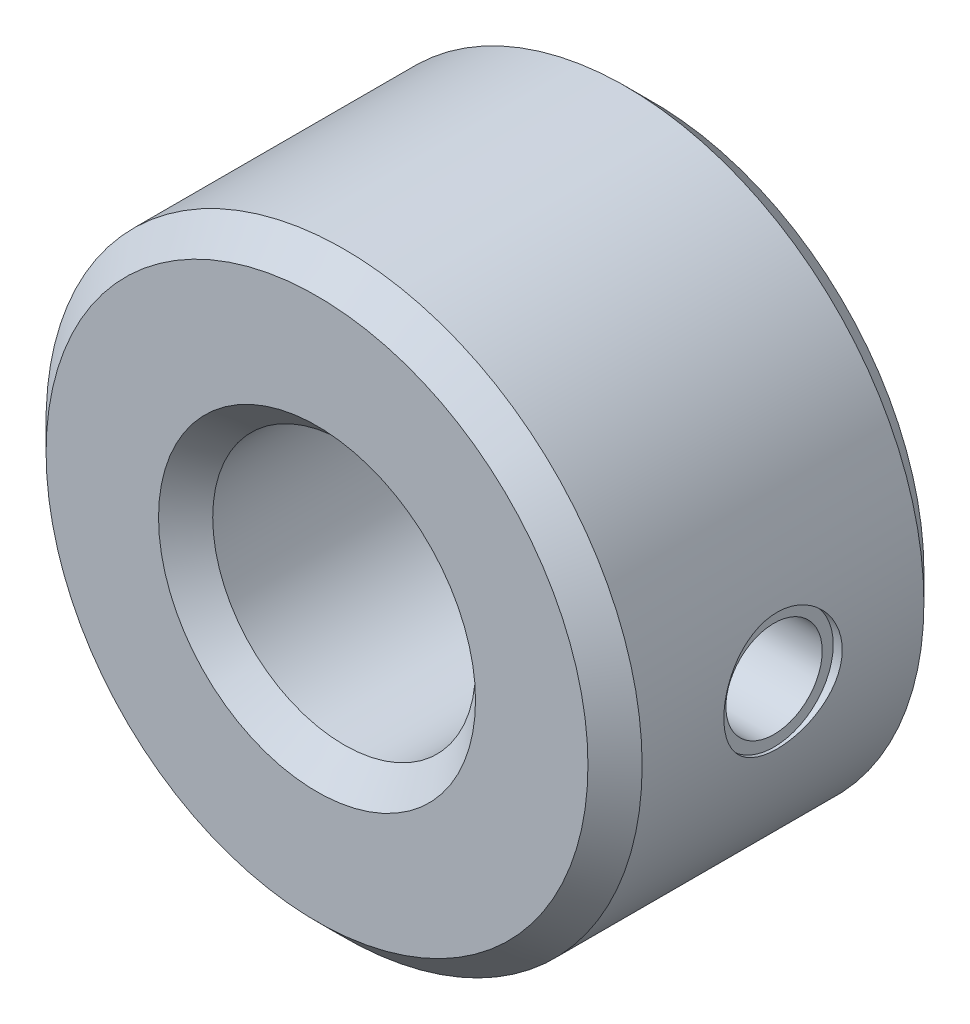
ISO-10303-21;
HEADER;
FILE_DESCRIPTION(('STEP AP214'),'2;1');
FILE_NAME('part.step','',(''),(''),'','','');
FILE_SCHEMA(('AUTOMOTIVE_DESIGN { 1 0 10303 214 1 1 1 1 }'));
ENDSEC;
DATA;
#1=APPLICATION_CONTEXT('core data for automotive mechanical design processes');
#2=APPLICATION_PROTOCOL_DEFINITION('international standard','automotive_design',2000,#1);
#3=PRODUCT_CONTEXT('',#1,'mechanical');
#4=PRODUCT('Part','Part','',(#3));
#5=PRODUCT_RELATED_PRODUCT_CATEGORY('part','',(#4));
#6=PRODUCT_DEFINITION_FORMATION('','',#4);
#7=PRODUCT_DEFINITION_CONTEXT('part definition',#1,'design');
#8=PRODUCT_DEFINITION('design','',#6,#7);
#9=PRODUCT_DEFINITION_SHAPE('','',#8);
#10=(LENGTH_UNIT() NAMED_UNIT(*) SI_UNIT(.MILLI.,.METRE.));
#11=(NAMED_UNIT(*) PLANE_ANGLE_UNIT() SI_UNIT($,.RADIAN.));
#12=(NAMED_UNIT(*) SI_UNIT($,.STERADIAN.) SOLID_ANGLE_UNIT());
#13=UNCERTAINTY_MEASURE_WITH_UNIT(LENGTH_MEASURE(1.E-05),#10,'distance_accuracy_value','');
#14=(GEOMETRIC_REPRESENTATION_CONTEXT(3) GLOBAL_UNCERTAINTY_ASSIGNED_CONTEXT((#13)) GLOBAL_UNIT_ASSIGNED_CONTEXT((#10,
#11,#12)) REPRESENTATION_CONTEXT('',''));
#15=CARTESIAN_POINT('',(0.,0.,0.));
#16=DIRECTION('',(0.,0.,1.));
#17=DIRECTION('',(1.,0.,0.));
#18=AXIS2_PLACEMENT_3D('',#15,#16,#17);
#19=CARTESIAN_POINT('',(0.,0.,2.59999999996512));
#20=DIRECTION('',(0.,0.,-1.));
#21=DIRECTION('',(-1.,0.,0.));
#22=AXIS2_PLACEMENT_3D('',#19,#20,#21);
#23=CONICAL_SURFACE('',#22,5.49999999987098,0.785398163397448);
#24=CARTESIAN_POINT('',(0.,0.,3.0999999998975));
#25=DIRECTION('',(0.,0.,1.));
#26=DIRECTION('',(1.,0.,0.));
#27=AXIS2_PLACEMENT_3D('',#24,#25,#26);
#28=CIRCLE('',#27,4.9999999999386);
#29=CARTESIAN_POINT('',(4.9999999999386,0.,3.0999999998975));
#30=VERTEX_POINT('',#29);
#31=EDGE_CURVE('E64',#30,#30,#28,.T.);
#32=ORIENTED_EDGE('',*,*,#31,.F.);
#33=EDGE_LOOP('',(#32));
#34=FACE_BOUND('',#33,.T.);
#35=CARTESIAN_POINT('',(0.,0.,2.59999999996512));
#36=DIRECTION('',(0.,0.,1.));
#37=DIRECTION('',(1.,0.,0.));
#38=AXIS2_PLACEMENT_3D('',#35,#36,#37);
#39=CIRCLE('',#38,5.49999999987098);
#40=CARTESIAN_POINT('',(5.49999999987098,0.,2.59999999996512));
#41=VERTEX_POINT('',#40);
#42=EDGE_CURVE('E10',#41,#41,#39,.T.);
#43=ORIENTED_EDGE('',*,*,#42,.T.);
#44=EDGE_LOOP('',(#43));
#45=FACE_BOUND('',#44,.T.);
#46=ADVANCED_FACE('F33',(#34,#45),#23,.T.);
#47=CARTESIAN_POINT('',(0.,0.,0.));
#48=DIRECTION('',(0.,0.,1.));
#49=DIRECTION('',(1.,0.,0.));
#50=AXIS2_PLACEMENT_3D('',#47,#48,#49);
#51=CYLINDRICAL_SURFACE('',#50,5.49999999987098);
#52=CARTESIAN_POINT('',(5.49999999987098,0.,-1.0922));
#53=CARTESIAN_POINT('',(5.4999988825837,-0.0607101232129737,-1.09219775609455));
#54=CARTESIAN_POINT('',(5.49898447977851,-0.121448708365151,-1.08712102316428));
#55=CARTESIAN_POINT('',(5.49503566367525,-0.241209661727449,-1.06696399701099));
#56=CARTESIAN_POINT('',(5.49209971397182,-0.300230617102368,-1.05187569873783));
#57=CARTESIAN_POINT('',(5.48463571286039,-0.414807398743242,-1.01217953319907));
#58=CARTESIAN_POINT('',(5.48010917668079,-0.470366463787665,-0.987580723631651));
#59=CARTESIAN_POINT('',(5.46995633835415,-0.576564866523423,-0.929588582793216));
#60=CARTESIAN_POINT('',(5.46433010443195,-0.627204509122269,-0.896195797052571));
#61=CARTESIAN_POINT('',(5.45251325206669,-0.722807169735393,-0.821090534500779));
#62=CARTESIAN_POINT('',(5.44631668432642,-0.767694986926346,-0.779283259975135));
#63=CARTESIAN_POINT('',(5.43410093997799,-0.849868711269153,-0.688739574431017));
#64=CARTESIAN_POINT('',(5.42808177712156,-0.887154030424212,-0.640002627948274));
#65=CARTESIAN_POINT('',(5.4168442893339,-0.953383600273373,-0.536443239116846));
#66=CARTESIAN_POINT('',(5.41163362092297,-0.982250143634702,-0.481570196113549));
#67=CARTESIAN_POINT('',(5.40268750519192,-1.03032496814664,-0.367632241251287));
#68=CARTESIAN_POINT('',(5.39895191432019,-1.04953418917835,-0.308567737957196));
#69=CARTESIAN_POINT('',(5.39343906549095,-1.07750528258289,-0.188732059035349));
#70=CARTESIAN_POINT('',(5.39163711542676,-1.08639900307728,-0.127992817377416));
#71=CARTESIAN_POINT('',(5.3901212347365,-1.09389613423502,-0.00585961765244284));
#72=CARTESIAN_POINT('',(5.39040709368507,-1.09250058192985,0.0555342738111984));
#73=CARTESIAN_POINT('',(5.39301209275884,-1.07956541897637,0.176270493881182));
#74=CARTESIAN_POINT('',(5.39530096430692,-1.06817681178237,0.235629750723884));
#75=CARTESIAN_POINT('',(5.40160644385572,-1.03581710938487,0.35157799764303));
#76=CARTESIAN_POINT('',(5.40562313331348,-1.01484556239594,0.408166856970469));
#77=CARTESIAN_POINT('',(5.41496269613146,-0.963770692785958,0.517403907568196));
#78=CARTESIAN_POINT('',(5.42029410397407,-0.933607387623006,0.570023293505699));
#79=CARTESIAN_POINT('',(5.43165688977912,-0.865047561118105,0.669510383150855));
#80=CARTESIAN_POINT('',(5.43768834705881,-0.826650106409138,0.71637743386528));
#81=CARTESIAN_POINT('',(5.44990285634747,-0.741902793202112,0.80390092540069));
#82=CARTESIAN_POINT('',(5.45608670025401,-0.695424022601307,0.844432535637155));
#83=CARTESIAN_POINT('',(5.46781126522681,-0.596262175775621,0.917143498749));
#84=CARTESIAN_POINT('',(5.47335197826643,-0.543579022132973,0.949322747388262));
#85=CARTESIAN_POINT('',(5.483179315787,-0.433366212874012,1.00443808103628));
#86=CARTESIAN_POINT('',(5.48746402179848,-0.375829314308617,1.02736004610524));
#87=CARTESIAN_POINT('',(5.49428198387236,-0.257617339178901,1.06317785057104));
#88=CARTESIAN_POINT('',(5.49681544904283,-0.196942638216196,1.07607488702404));
#89=CARTESIAN_POINT('',(5.49981640134946,-0.0752502519772616,1.09130035072367));
#90=CARTESIAN_POINT('',(5.50031728454035,-0.0142547412616139,1.09379963423744));
#91=CARTESIAN_POINT('',(5.49928933819061,0.107282369093851,1.08861857053011));
#92=CARTESIAN_POINT('',(5.49776062106432,0.167823993686482,1.08093878710137));
#93=CARTESIAN_POINT('',(5.49286612910723,0.286184662739495,1.05575954831863));
#94=CARTESIAN_POINT('',(5.48951673565154,0.344023063522988,1.0383476182225));
#95=CARTESIAN_POINT('',(5.48135506679043,0.4559593673962,0.994293882467879));
#96=CARTESIAN_POINT('',(5.476542682948,0.510056992854236,0.967651392618717));
#97=CARTESIAN_POINT('',(5.46590566743375,0.613697679422892,0.905522204864626));
#98=CARTESIAN_POINT('',(5.46006949987753,0.663177760485838,0.869932463552538));
#99=CARTESIAN_POINT('',(5.44805972673938,0.755524735338425,0.791057177745034));
#100=CARTESIAN_POINT('',(5.44188608557451,0.798390929936717,0.747770820636539));
#101=CARTESIAN_POINT('',(5.42978480912782,0.87695154789536,0.653953743420826));
#102=CARTESIAN_POINT('',(5.42386225264541,0.91252875681699,0.603324102236613));
#103=CARTESIAN_POINT('',(5.4130406766035,0.974674173285588,0.496707015802831));
#104=CARTESIAN_POINT('',(5.40814161640261,1.00124273857741,0.440719783423354));
#105=CARTESIAN_POINT('',(5.39996260729193,1.04445593485777,0.325256982636461));
#106=CARTESIAN_POINT('',(5.39667434247771,1.06115163028267,0.265801142762739));
#107=CARTESIAN_POINT('',(5.39207145238588,1.08430034524308,0.144855868606561));
#108=CARTESIAN_POINT('',(5.39075657383323,1.09075467921621,0.083366696328456));
#109=CARTESIAN_POINT('',(5.39026325277416,1.09318934845028,-0.0387232631786108));
#110=CARTESIAN_POINT('',(5.39104703759951,1.08935486377822,-0.0993202810323704));
#111=CARTESIAN_POINT('',(5.39457840935009,1.0717290590583,-0.218987177976653));
#112=CARTESIAN_POINT('',(5.39732598099302,1.05793781649457,-0.278057068947669));
#113=CARTESIAN_POINT('',(5.40445856907003,1.02087207022523,-0.392877228902362));
#114=CARTESIAN_POINT('',(5.40883971583554,0.997619965950032,-0.448634984763973));
#115=CARTESIAN_POINT('',(5.41874807986904,0.942313673220461,-0.555486937986287));
#116=CARTESIAN_POINT('',(5.42427539149153,0.910258760031397,-0.606580750903184));
#117=CARTESIAN_POINT('',(5.43596906680853,0.837622971725841,-0.703577187462301));
#118=CARTESIAN_POINT('',(5.44214458614618,0.796908242762451,-0.749378489039133));
#119=CARTESIAN_POINT('',(5.45437281759908,0.708385237708941,-0.833560201426262));
#120=CARTESIAN_POINT('',(5.46042550117137,0.660575333911476,-0.871938904749342));
#121=CARTESIAN_POINT('',(5.47179949202526,0.55862805925471,-0.940558502923561));
#122=CARTESIAN_POINT('',(5.47711263145339,0.504430634147923,-0.970711584469282));
#123=CARTESIAN_POINT('',(5.48632857296824,0.391648031665486,-1.02143459356755));
#124=CARTESIAN_POINT('',(5.49023265178984,0.333066884747255,-1.04201320136286));
#125=CARTESIAN_POINT('',(5.4954277643953,0.228624445457653,-1.06899512000464));
#126=CARTESIAN_POINT('',(5.49713235964371,0.183359638525113,-1.07768151083087));
#127=CARTESIAN_POINT('',(5.49941888361477,0.0920686620738702,-1.08928471208051));
#128=CARTESIAN_POINT('',(5.5000008472209,0.0460425162570459,-1.09220170177637));
#129=CARTESIAN_POINT('',(5.49999999987098,0.,-1.0922));
#130=B_SPLINE_CURVE_WITH_KNOTS('',3,(#52,#53,#54,#55,#56,#57,#58,#59,#60,#61,#62,#63,#64,#65,
#66,#67,#68,#69,#70,#71,#72,#73,#74,#75,#76,#77,#78,#79,#80,#81,#82,#83,#84,#85,#86,#87,#88,#89,
#90,#91,#92,#93,#94,#95,#96,#97,#98,#99,#100,#101,#102,#103,#104,#105,#106,#107,#108,#109,#110,
#111,#112,#113,#114,#115,#116,#117,#118,#119,#120,#121,#122,#123,#124,#125,#126,#127,#128,#129),
.UNSPECIFIED.,.T.,.F.,(4,2,2,2,2,2,2,2,2,2,2,2,2,2,2,2,2,2,2,2,2,2,2,2,2,2,2,2,2,2,2,2,2,2,2,2,
2,2,4),(0.,0.181961938973314,0.364069546730696,0.546004142906751,0.727927455509229,
0.912028282774288,1.09614334347538,1.28190762621811,1.46765382629278,1.65099878729389,
1.83432526964225,2.01492833792818,2.19553992158147,2.37735631915007,2.55919333708933,
2.74425394834676,2.92931686901957,3.11466100576973,3.29998300755534,3.4822474624557,
3.66450182261818,3.84514287175689,4.02579731329834,4.20863611409276,4.39149423058699,
4.57709506697592,4.76268853205291,4.9473134791697,5.13191472849869,5.31321587725928,
5.49451561513803,5.67538858459799,5.85627644978468,6.04019509434184,6.22415599717173,
6.41001009592981,6.5956953689651,6.73369946829882,6.87169927936743),.UNSPECIFIED.);
#131=CARTESIAN_POINT('',(5.49999999987098,0.,-1.0922));
#132=VERTEX_POINT('',#131);
#133=EDGE_CURVE('E36',#132,#132,#130,.T.);
#134=ORIENTED_EDGE('',*,*,#133,.T.);
#135=EDGE_LOOP('',(#134));
#136=FACE_BOUND('',#135,.T.);
#137=ORIENTED_EDGE('',*,*,#42,.F.);
#138=EDGE_LOOP('',(#137));
#139=FACE_BOUND('',#138,.T.);
#140=CARTESIAN_POINT('',(0.,0.,-2.60000000019896));
#141=DIRECTION('',(0.,0.,1.));
#142=DIRECTION('',(1.,0.,0.));
#143=AXIS2_PLACEMENT_3D('',#140,#141,#142);
#144=CIRCLE('',#143,5.49999999987098);
#145=CARTESIAN_POINT('',(5.49999999987098,0.,-2.60000000019896));
#146=VERTEX_POINT('',#145);
#147=EDGE_CURVE('E43',#146,#146,#144,.T.);
#148=ORIENTED_EDGE('',*,*,#147,.T.);
#149=EDGE_LOOP('',(#148));
#150=FACE_BOUND('',#149,.T.);
#151=ADVANCED_FACE('F93',(#136,#139,#150),#51,.T.);
#152=CARTESIAN_POINT('',(0.,0.,-3.10000000007449));
#153=DIRECTION('',(0.,0.,1.));
#154=DIRECTION('',(1.,0.,0.));
#155=AXIS2_PLACEMENT_3D('',#152,#153,#154);
#156=CONICAL_SURFACE('',#155,4.99999999999545,0.785398163397448);
#157=ORIENTED_EDGE('',*,*,#147,.F.);
#158=EDGE_LOOP('',(#157));
#159=FACE_BOUND('',#158,.T.);
#160=CARTESIAN_POINT('',(0.,0.,-3.10000000007449));
#161=DIRECTION('',(0.,0.,1.));
#162=DIRECTION('',(1.,0.,0.));
#163=AXIS2_PLACEMENT_3D('',#160,#161,#162);
#164=CIRCLE('',#163,4.99999999999545);
#165=CARTESIAN_POINT('',(4.99999999999545,0.,-3.10000000007449));
#166=VERTEX_POINT('',#165);
#167=EDGE_CURVE('E47',#166,#166,#164,.T.);
#168=ORIENTED_EDGE('',*,*,#167,.T.);
#169=EDGE_LOOP('',(#168));
#170=FACE_BOUND('',#169,.T.);
#171=ADVANCED_FACE('F98',(#159,#170),#156,.T.);
#172=CARTESIAN_POINT('',(0.,4.99999999999545,-3.10000000007449));
#173=DIRECTION('',(0.,0.,1.));
#174=DIRECTION('',(1.,0.,0.));
#175=AXIS2_PLACEMENT_3D('',#172,#173,#174);
#176=PLANE('',#175);
#177=ORIENTED_EDGE('',*,*,#167,.F.);
#178=EDGE_LOOP('',(#177));
#179=FACE_BOUND('',#178,.T.);
#180=CARTESIAN_POINT('',(0.,0.,-3.10000000007449));
#181=DIRECTION('',(0.,0.,1.));
#182=DIRECTION('',(1.,0.,0.));
#183=AXIS2_PLACEMENT_3D('',#180,#181,#182);
#184=CIRCLE('',#183,2.92500000000473);
#185=CARTESIAN_POINT('',(2.92500000000473,0.,-3.10000000007449));
#186=VERTEX_POINT('',#185);
#187=EDGE_CURVE('E52',#186,#186,#184,.T.);
#188=ORIENTED_EDGE('',*,*,#187,.T.);
#189=EDGE_LOOP('',(#188));
#190=FACE_BOUND('',#189,.T.);
#191=ADVANCED_FACE('F124',(#179,#190),#176,.F.);
#192=CARTESIAN_POINT('',(0.,0.,-2.60000000003488));
#193=DIRECTION('',(0.,0.,-1.));
#194=DIRECTION('',(-1.,0.,0.));
#195=AXIS2_PLACEMENT_3D('',#192,#193,#194);
#196=CONICAL_SURFACE('',#195,2.42499999996512,0.785398163397449);
#197=ORIENTED_EDGE('',*,*,#187,.F.);
#198=EDGE_LOOP('',(#197));
#199=FACE_BOUND('',#198,.T.);
#200=CARTESIAN_POINT('',(0.,0.,-2.60000000003488));
#201=DIRECTION('',(0.,0.,1.));
#202=DIRECTION('',(1.,0.,0.));
#203=AXIS2_PLACEMENT_3D('',#200,#201,#202);
#204=CIRCLE('',#203,2.42499999996512);
#205=CARTESIAN_POINT('',(2.42499999996512,0.,-2.60000000003488));
#206=VERTEX_POINT('',#205);
#207=EDGE_CURVE('E55',#206,#206,#204,.T.);
#208=ORIENTED_EDGE('',*,*,#207,.T.);
#209=EDGE_LOOP('',(#208));
#210=FACE_BOUND('',#209,.T.);
#211=ADVANCED_FACE('F120',(#199,#210),#196,.F.);
#212=CARTESIAN_POINT('',(0.,0.,0.));
#213=DIRECTION('',(0.,0.,1.));
#214=DIRECTION('',(1.,0.,0.));
#215=AXIS2_PLACEMENT_3D('',#212,#213,#214);
#216=CYLINDRICAL_SURFACE('',#215,2.42499999996512);
#217=CARTESIAN_POINT('',(2.42499999996512,0.,-0.888999999999993));
#218=CARTESIAN_POINT('',(2.42500100698607,0.0482210733691131,-0.88900136785869));
#219=CARTESIAN_POINT('',(2.42354900881088,0.0964325798290843,-0.885064210399218));
#220=CARTESIAN_POINT('',(2.41790134051433,0.191418969642659,-0.869480028305529));
#221=CARTESIAN_POINT('',(2.41370592945456,0.23819398820779,-0.857833731647152));
#222=CARTESIAN_POINT('',(2.40302295069491,0.328924069637065,-0.827295673325916));
#223=CARTESIAN_POINT('',(2.39653968501225,0.372884243412213,-0.808417504609129));
#224=CARTESIAN_POINT('',(2.38193004014253,0.457011585366046,-0.76401911226756));
#225=CARTESIAN_POINT('',(2.37380324186406,0.497177782262117,-0.73849719404701));
#226=CARTESIAN_POINT('',(2.35637780561288,0.574218217800045,-0.680445250293989));
#227=CARTESIAN_POINT('',(2.34704702975714,0.610916701722731,-0.647691711963635));
#228=CARTESIAN_POINT('',(2.32842720240065,0.678440000366793,-0.57658084564624));
#229=CARTESIAN_POINT('',(2.31913816360556,0.709263131054562,-0.538221916553094));
#230=CARTESIAN_POINT('',(2.30128399750112,0.765253836594293,-0.455300488280666));
#231=CARTESIAN_POINT('',(2.29275706269015,0.790177338396631,-0.41056414397642));
#232=CARTESIAN_POINT('',(2.27789022908686,0.832069046647046,-0.317172530989722));
#233=CARTESIAN_POINT('',(2.27154950098971,0.849040270551857,-0.268518756983953));
#234=CARTESIAN_POINT('',(2.26211549628535,0.873858980069791,-0.170692298713814));
#235=CARTESIAN_POINT('',(2.25890371436834,0.882040725656034,-0.121616220689416));
#236=CARTESIAN_POINT('',(2.2557436123785,0.890093443349021,-0.0226907045611991));
#237=CARTESIAN_POINT('',(2.25579402007148,0.889967655343159,0.0271584244745418));
#238=CARTESIAN_POINT('',(2.2590500685017,0.88166528262795,0.123202570603927));
#239=CARTESIAN_POINT('',(2.26207636282283,0.873946303651867,0.169444337252091));
#240=CARTESIAN_POINT('',(2.27064610481337,0.851431056823233,0.259923761462362));
#241=CARTESIAN_POINT('',(2.27618991457101,0.836633770898318,0.304161129729716));
#242=CARTESIAN_POINT('',(2.28928206582164,0.80012083414507,0.390330857499101));
#243=CARTESIAN_POINT('',(2.29686537655744,0.778283026959538,0.432205909132851));
#244=CARTESIAN_POINT('',(2.31316980663926,0.72839398160483,0.511832433782764));
#245=CARTESIAN_POINT('',(2.32189130588114,0.700340666679922,0.54958252223632));
#246=CARTESIAN_POINT('',(2.34017068454703,0.636701566124038,0.622428986785978));
#247=CARTESIAN_POINT('',(2.34974636830766,0.600748598411384,0.657200881301793));
#248=CARTESIAN_POINT('',(2.3681735594469,0.523409555108558,0.72031588662745));
#249=CARTESIAN_POINT('',(2.37702496506252,0.482022718165883,0.748658095037671));
#250=CARTESIAN_POINT('',(2.39316862760413,0.394192667152664,0.798445994912168));
#251=CARTESIAN_POINT('',(2.40043697270386,0.347686025386372,0.819788095711793));
#252=CARTESIAN_POINT('',(2.41241911954111,0.251410160102956,0.854239312306274));
#253=CARTESIAN_POINT('',(2.4171340034096,0.201642328684554,0.867351916053275));
#254=CARTESIAN_POINT('',(2.4232900579738,0.102991117848372,0.884358478668013));
#255=CARTESIAN_POINT('',(2.42488635097679,0.0541927187643962,0.888689685685409));
#256=CARTESIAN_POINT('',(2.42510175993381,-0.0434538146740229,0.889277883317595));
#257=CARTESIAN_POINT('',(2.42372150152423,-0.0923019364202604,0.885536570681774));
#258=CARTESIAN_POINT('',(2.41824134814683,-0.186801272325406,0.870421408731829));
#259=CARTESIAN_POINT('',(2.41424221994732,-0.232504139327404,0.859330181658875));
#260=CARTESIAN_POINT('',(2.4040273962655,-0.321371212600787,0.830198182936385));
#261=CARTESIAN_POINT('',(2.39781141239167,-0.364535087722363,0.812156507076056));
#262=CARTESIAN_POINT('',(2.38355726639088,-0.448493267643666,0.769067931000062));
#263=CARTESIAN_POINT('',(2.37547169316827,-0.489183234400813,0.743833885602861));
#264=CARTESIAN_POINT('',(2.35837785523973,-0.565884751199542,0.687289989858015));
#265=CARTESIAN_POINT('',(2.34936926150017,-0.60189462245517,0.655977969282013));
#266=CARTESIAN_POINT('',(2.33080481647214,-0.670298117212239,0.586123679239295));
#267=CARTESIAN_POINT('',(2.32124629297807,-0.702380930349654,0.547276980219865));
#268=CARTESIAN_POINT('',(2.30314849405498,-0.759628937407653,0.464558553131063));
#269=CARTESIAN_POINT('',(2.29460928927857,-0.784793651967574,0.420686477147477));
#270=CARTESIAN_POINT('',(2.27956517094431,-0.827480526178416,0.328884056279312));
#271=CARTESIAN_POINT('',(2.27306562910083,-0.84498255221256,0.280943410724381));
#272=CARTESIAN_POINT('',(2.26301076178163,-0.871557855325629,0.18249270470527));
#273=CARTESIAN_POINT('',(2.25945372405557,-0.880636034636452,0.131984156699833));
#274=CARTESIAN_POINT('',(2.25590742936657,-0.889678585208109,0.0331822639541626));
#275=CARTESIAN_POINT('',(2.25571189204201,-0.890169925632735,-0.0150558764415823));
#276=CARTESIAN_POINT('',(2.25838579665335,-0.883363850838639,-0.110888332662416));
#277=CARTESIAN_POINT('',(2.26125497376958,-0.87606710858236,-0.15848270375529));
#278=CARTESIAN_POINT('',(2.26956689578921,-0.854295125442194,-0.250335371425855));
#279=CARTESIAN_POINT('',(2.27493571013626,-0.840025552104172,-0.294649670250881));
#280=CARTESIAN_POINT('',(2.28760200601424,-0.804890733973314,-0.380283224518578));
#281=CARTESIAN_POINT('',(2.29489996435986,-0.784023858315408,-0.421601736289219));
#282=CARTESIAN_POINT('',(2.31106283229248,-0.735057488840072,-0.502347027751753));
#283=CARTESIAN_POINT('',(2.31998842938895,-0.706644924461949,-0.541571670078021));
#284=CARTESIAN_POINT('',(2.338183128204,-0.64388746636034,-0.614865211971732));
#285=CARTESIAN_POINT('',(2.34745233589173,-0.609540730386526,-0.648932504270802));
#286=CARTESIAN_POINT('',(2.36585526134065,-0.533803014888732,-0.712704359371678));
#287=CARTESIAN_POINT('',(2.37495819510107,-0.492142888308652,-0.742099520833097));
#288=CARTESIAN_POINT('',(2.39150239767928,-0.404156959286368,-0.793455943231014));
#289=CARTESIAN_POINT('',(2.39894366069963,-0.357831140566743,-0.815417178231253));
#290=CARTESIAN_POINT('',(2.41146712805532,-0.260593690315703,-0.851566993445974));
#291=CARTESIAN_POINT('',(2.41648669328279,-0.209597195125041,-0.865550741327238));
#292=CARTESIAN_POINT('',(2.42325184725216,-0.105729403503614,-0.884264431414727));
#293=CARTESIAN_POINT('',(2.42499889608936,-0.0528589539069761,-0.888998500581279));
#294=CARTESIAN_POINT('',(2.42499999996512,0.,-0.888999999999993));
#295=B_SPLINE_CURVE_WITH_KNOTS('',3,(#217,#218,#219,#220,#221,#222,#223,#224,#225,#226,#227,
#228,#229,#230,#231,#232,#233,#234,#235,#236,#237,#238,#239,#240,#241,#242,#243,#244,#245,#246,
#247,#248,#249,#250,#251,#252,#253,#254,#255,#256,#257,#258,#259,#260,#261,#262,#263,#264,#265,
#266,#267,#268,#269,#270,#271,#272,#273,#274,#275,#276,#277,#278,#279,#280,#281,#282,#283,#284,
#285,#286,#287,#288,#289,#290,#291,#292,#293,#294),.UNSPECIFIED.,.T.,.F.,(4,2,2,2,2,2,2,2,2,2,2,
2,2,2,2,2,2,2,2,2,2,2,2,2,2,2,2,2,2,2,2,2,2,2,2,2,2,2,4),(0.,0.144468339571718,0.28892303890972,
0.433107544530538,0.577328862838107,0.726862509936614,0.87643895314622,1.03141014166116,
1.18632247932946,1.33510877950857,1.48383705428152,1.62411913683577,1.76442140222104,
1.90730232847955,2.05023106699758,2.20230761952611,2.35440550265099,2.50866209344886,
2.66285326061256,2.80915713334014,2.95543025769735,3.09638198590335,3.23735205726104,
3.38239055587262,3.52748093814553,3.68060837726698,3.83374642404016,3.98728445903894,
4.14073308690708,4.28472915869487,4.42871278889622,4.56868482651217,4.70869149255902,
4.85579690469834,5.00294806771497,5.15757186269242,5.31219619713196,5.47063013996055,
5.62899337762606),.UNSPECIFIED.);
#296=CARTESIAN_POINT('',(2.42499999996512,0.,-0.888999999999993));
#297=VERTEX_POINT('',#296);
#298=EDGE_CURVE('E70',#297,#297,#295,.T.);
#299=ORIENTED_EDGE('',*,*,#298,.T.);
#300=EDGE_LOOP('',(#299));
#301=FACE_BOUND('',#300,.T.);
#302=ORIENTED_EDGE('',*,*,#207,.F.);
#303=EDGE_LOOP('',(#302));
#304=FACE_BOUND('',#303,.T.);
#305=CARTESIAN_POINT('',(0.,0.,2.59999999991473));
#306=DIRECTION('',(0.,0.,1.));
#307=DIRECTION('',(1.,0.,0.));
#308=AXIS2_PLACEMENT_3D('',#305,#306,#307);
#309=CIRCLE('',#308,2.42499999996512);
#310=CARTESIAN_POINT('',(2.42499999996512,0.,2.59999999991473));
#311=VERTEX_POINT('',#310);
#312=EDGE_CURVE('E58',#311,#311,#309,.T.);
#313=ORIENTED_EDGE('',*,*,#312,.T.);
#314=EDGE_LOOP('',(#313));
#315=FACE_BOUND('',#314,.T.);
#316=ADVANCED_FACE('F112',(#301,#304,#315),#216,.F.);
#317=CARTESIAN_POINT('',(0.,0.,3.0999999998975));
#318=DIRECTION('',(0.,0.,1.));
#319=DIRECTION('',(1.,0.,0.));
#320=AXIS2_PLACEMENT_3D('',#317,#318,#319);
#321=CONICAL_SURFACE('',#320,2.92499999994789,0.785398163397448);
#322=ORIENTED_EDGE('',*,*,#312,.F.);
#323=EDGE_LOOP('',(#322));
#324=FACE_BOUND('',#323,.T.);
#325=CARTESIAN_POINT('',(0.,0.,3.0999999998975));
#326=DIRECTION('',(0.,0.,1.));
#327=DIRECTION('',(1.,0.,0.));
#328=AXIS2_PLACEMENT_3D('',#325,#326,#327);
#329=CIRCLE('',#328,2.92499999994789);
#330=CARTESIAN_POINT('',(2.92499999994789,0.,3.0999999998975));
#331=VERTEX_POINT('',#330);
#332=EDGE_CURVE('E61',#331,#331,#329,.T.);
#333=ORIENTED_EDGE('',*,*,#332,.T.);
#334=EDGE_LOOP('',(#333));
#335=FACE_BOUND('',#334,.T.);
#336=ADVANCED_FACE('F104',(#324,#335),#321,.F.);
#337=CARTESIAN_POINT('',(0.,4.9999999999386,3.0999999998975));
#338=DIRECTION('',(0.,0.,-1.));
#339=DIRECTION('',(-1.,0.,0.));
#340=AXIS2_PLACEMENT_3D('',#337,#338,#339);
#341=PLANE('',#340);
#342=ORIENTED_EDGE('',*,*,#332,.F.);
#343=EDGE_LOOP('',(#342));
#344=FACE_BOUND('',#343,.T.);
#345=ORIENTED_EDGE('',*,*,#31,.T.);
#346=EDGE_LOOP('',(#345));
#347=FACE_BOUND('',#346,.T.);
#348=ADVANCED_FACE('F102',(#344,#347),#341,.F.);
#349=CARTESIAN_POINT('',(5.334,0.,0.));
#350=DIRECTION('',(1.,0.,0.));
#351=DIRECTION('',(0.,0.,-1.));
#352=AXIS2_PLACEMENT_3D('',#349,#350,#351);
#353=CYLINDRICAL_SURFACE('',#352,1.0922);
#354=CARTESIAN_POINT('',(5.334,0.,0.));
#355=DIRECTION('',(1.,0.,0.));
#356=DIRECTION('',(0.,0.,-1.));
#357=AXIS2_PLACEMENT_3D('',#354,#355,#356);
#358=CIRCLE('',#357,1.0922);
#359=CARTESIAN_POINT('',(5.334,0.,-1.0922));
#360=VERTEX_POINT('',#359);
#361=EDGE_CURVE('E67',#360,#360,#358,.T.);
#362=ORIENTED_EDGE('',*,*,#361,.F.);
#363=EDGE_LOOP('',(#362));
#364=FACE_BOUND('',#363,.T.);
#365=ORIENTED_EDGE('',*,*,#133,.F.);
#366=EDGE_LOOP('',(#365));
#367=FACE_BOUND('',#366,.T.);
#368=ADVANCED_FACE('F88',(#364,#367),#353,.F.);
#369=CARTESIAN_POINT('',(5.334,0.,0.));
#370=DIRECTION('',(1.,0.,0.));
#371=DIRECTION('',(0.,0.,-1.));
#372=AXIS2_PLACEMENT_3D('',#369,#370,#371);
#373=PLANE('',#372);
#374=CARTESIAN_POINT('',(5.334,0.,0.));
#375=DIRECTION('',(1.,0.,0.));
#376=DIRECTION('',(0.,0.,-1.));
#377=AXIS2_PLACEMENT_3D('',#374,#375,#376);
#378=CIRCLE('',#377,0.888999999999987);
#379=CARTESIAN_POINT('',(5.334,0.,-0.888999999999987));
#380=VERTEX_POINT('',#379);
#381=EDGE_CURVE('E77',#380,#380,#378,.T.);
#382=ORIENTED_EDGE('',*,*,#381,.F.);
#383=EDGE_LOOP('',(#382));
#384=FACE_BOUND('',#383,.T.);
#385=ORIENTED_EDGE('',*,*,#361,.T.);
#386=EDGE_LOOP('',(#385));
#387=FACE_BOUND('',#386,.T.);
#388=ADVANCED_FACE('F83',(#384,#387),#373,.T.);
#389=CARTESIAN_POINT('',(5.334,0.,0.));
#390=DIRECTION('',(1.,0.,0.));
#391=DIRECTION('',(0.,0.,-1.));
#392=AXIS2_PLACEMENT_3D('',#389,#390,#391);
#393=CYLINDRICAL_SURFACE('',#392,0.888999999999993);
#394=ORIENTED_EDGE('',*,*,#298,.F.);
#395=EDGE_LOOP('',(#394));
#396=FACE_BOUND('',#395,.T.);
#397=ORIENTED_EDGE('',*,*,#381,.T.);
#398=EDGE_LOOP('',(#397));
#399=FACE_BOUND('',#398,.T.);
#400=ADVANCED_FACE('F80',(#396,#399),#393,.F.);
#401=CLOSED_SHELL('',(#46,#151,#171,#191,#211,#316,#336,#348,#368,#388,#400));
#402=MANIFOLD_SOLID_BREP('B2',#401);
#403=ADVANCED_BREP_SHAPE_REPRESENTATION('',(#18,#402),#14);
#404=SHAPE_DEFINITION_REPRESENTATION(#9,#403);
ENDSEC;
END-ISO-10303-21;
